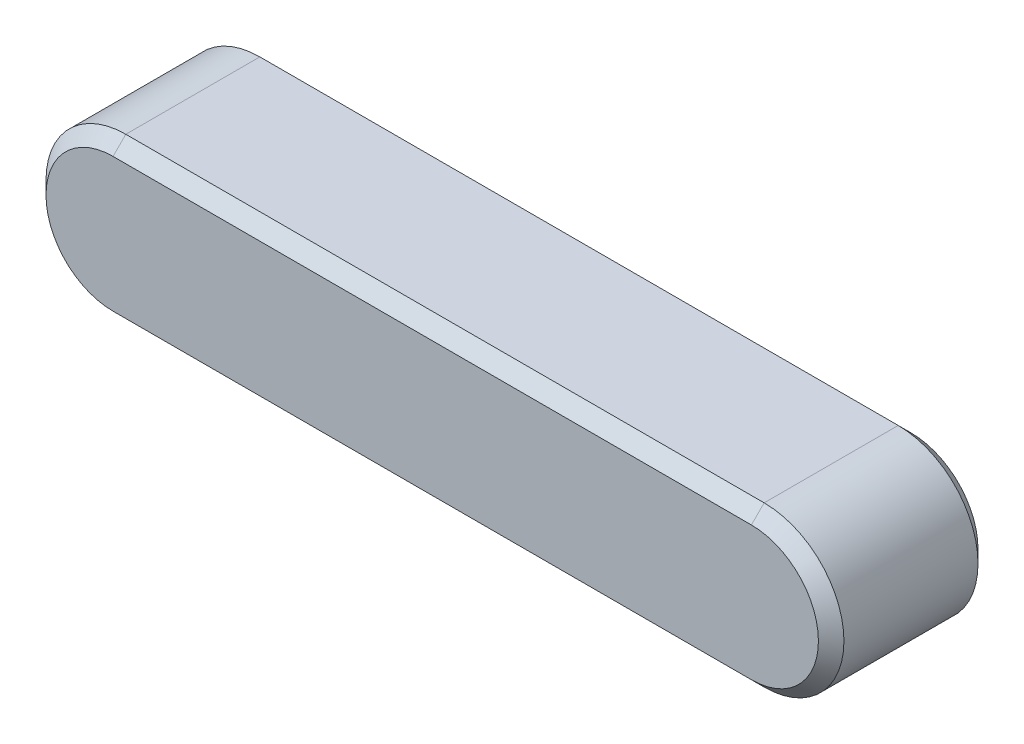
ISO-10303-21;
HEADER;
FILE_DESCRIPTION(('STEP AP214'),'2;1');
FILE_NAME('part.step','',(''),(''),'','','');
FILE_SCHEMA(('AUTOMOTIVE_DESIGN { 1 0 10303 214 1 1 1 1 }'));
ENDSEC;
DATA;
#1=APPLICATION_CONTEXT('core data for automotive mechanical design processes');
#2=APPLICATION_PROTOCOL_DEFINITION('international standard','automotive_design',2000,#1);
#3=PRODUCT_CONTEXT('',#1,'mechanical');
#4=PRODUCT('Part','Part','',(#3));
#5=PRODUCT_RELATED_PRODUCT_CATEGORY('part','',(#4));
#6=PRODUCT_DEFINITION_FORMATION('','',#4);
#7=PRODUCT_DEFINITION_CONTEXT('part definition',#1,'design');
#8=PRODUCT_DEFINITION('design','',#6,#7);
#9=PRODUCT_DEFINITION_SHAPE('','',#8);
#10=(LENGTH_UNIT() NAMED_UNIT(*) SI_UNIT(.MILLI.,.METRE.));
#11=(NAMED_UNIT(*) PLANE_ANGLE_UNIT() SI_UNIT($,.RADIAN.));
#12=(NAMED_UNIT(*) SI_UNIT($,.STERADIAN.) SOLID_ANGLE_UNIT());
#13=UNCERTAINTY_MEASURE_WITH_UNIT(LENGTH_MEASURE(1.E-05),#10,'distance_accuracy_value','');
#14=(GEOMETRIC_REPRESENTATION_CONTEXT(3) GLOBAL_UNCERTAINTY_ASSIGNED_CONTEXT((#13)) GLOBAL_UNIT_ASSIGNED_CONTEXT((#10,
#11,#12)) REPRESENTATION_CONTEXT('',''));
#15=CARTESIAN_POINT('',(0.,0.,0.));
#16=DIRECTION('',(0.,0.,1.));
#17=DIRECTION('',(1.,0.,0.));
#18=AXIS2_PLACEMENT_3D('',#15,#16,#17);
#19=CARTESIAN_POINT('',(-20.,0.,2.5));
#20=DIRECTION('',(0.,0.,-1.));
#21=DIRECTION('',(-1.,0.,0.));
#22=AXIS2_PLACEMENT_3D('',#19,#20,#21);
#23=CYLINDRICAL_SURFACE('',#22,2.5);
#24=DIRECTION('',(0.,0.,-1.));
#25=VECTOR('',#24,1.);
#26=CARTESIAN_POINT('',(-20.,-2.5,2.5));
#27=LINE('',#26,#25);
#28=CARTESIAN_POINT('',(-20.,-2.5,2.1));
#29=VERTEX_POINT('',#28);
#30=CARTESIAN_POINT('',(-20.,-2.5,-2.1));
#31=VERTEX_POINT('',#30);
#32=EDGE_CURVE('E122',#29,#31,#27,.T.);
#33=ORIENTED_EDGE('',*,*,#32,.F.);
#34=CARTESIAN_POINT('',(-20.,0.,2.1));
#35=DIRECTION('',(0.,0.,-1.));
#36=DIRECTION('',(-1.,0.,0.));
#37=AXIS2_PLACEMENT_3D('',#34,#35,#36);
#38=CIRCLE('',#37,2.5);
#39=CARTESIAN_POINT('',(-20.,2.5,2.1));
#40=VERTEX_POINT('',#39);
#41=EDGE_CURVE('E56',#29,#40,#38,.T.);
#42=ORIENTED_EDGE('',*,*,#41,.T.);
#43=DIRECTION('',(0.,0.,-1.));
#44=VECTOR('',#43,1.);
#45=CARTESIAN_POINT('',(-20.,2.5,2.5));
#46=LINE('',#45,#44);
#47=CARTESIAN_POINT('',(-20.,2.5,-2.1));
#48=VERTEX_POINT('',#47);
#49=EDGE_CURVE('E160',#40,#48,#46,.T.);
#50=ORIENTED_EDGE('',*,*,#49,.T.);
#51=CARTESIAN_POINT('',(-20.,0.,-2.1));
#52=DIRECTION('',(0.,0.,-1.));
#53=DIRECTION('',(-1.,0.,0.));
#54=AXIS2_PLACEMENT_3D('',#51,#52,#53);
#55=CIRCLE('',#54,2.5);
#56=EDGE_CURVE('E110',#48,#31,#55,.F.);
#57=ORIENTED_EDGE('',*,*,#56,.T.);
#58=EDGE_LOOP('',(#33,#42,#50,#57));
#59=FACE_BOUND('',#58,.T.);
#60=ADVANCED_FACE('F33',(#59),#23,.T.);
#61=CARTESIAN_POINT('',(0.,-2.5,2.5));
#62=DIRECTION('',(0.,1.,0.));
#63=DIRECTION('',(-1.,0.,0.));
#64=AXIS2_PLACEMENT_3D('',#61,#62,#63);
#65=PLANE('',#64);
#66=ORIENTED_EDGE('',*,*,#32,.T.);
#67=DIRECTION('',(1.,0.,0.));
#68=VECTOR('',#67,1.);
#69=CARTESIAN_POINT('',(0.,-2.5,-2.1));
#70=LINE('',#69,#68);
#71=CARTESIAN_POINT('',(0.,-2.5,-2.1));
#72=VERTEX_POINT('',#71);
#73=EDGE_CURVE('E121',#31,#72,#70,.T.);
#74=ORIENTED_EDGE('',*,*,#73,.T.);
#75=DIRECTION('',(0.,0.,-1.));
#76=VECTOR('',#75,1.);
#77=CARTESIAN_POINT('',(0.,-2.5,2.5));
#78=LINE('',#77,#76);
#79=CARTESIAN_POINT('',(0.,-2.5,2.1));
#80=VERTEX_POINT('',#79);
#81=EDGE_CURVE('E104',#80,#72,#78,.T.);
#82=ORIENTED_EDGE('',*,*,#81,.F.);
#83=DIRECTION('',(-1.,0.,0.));
#84=VECTOR('',#83,1.);
#85=CARTESIAN_POINT('',(0.,-2.5,2.1));
#86=LINE('',#85,#84);
#87=EDGE_CURVE('E119',#80,#29,#86,.T.);
#88=ORIENTED_EDGE('',*,*,#87,.T.);
#89=EDGE_LOOP('',(#66,#74,#82,#88));
#90=FACE_BOUND('',#89,.T.);
#91=ADVANCED_FACE('F118',(#90),#65,.F.);
#92=CARTESIAN_POINT('',(0.,0.,2.5));
#93=DIRECTION('',(0.,0.,-1.));
#94=DIRECTION('',(-1.,0.,0.));
#95=AXIS2_PLACEMENT_3D('',#92,#93,#94);
#96=CYLINDRICAL_SURFACE('',#95,2.5);
#97=DIRECTION('',(0.,0.,-1.));
#98=VECTOR('',#97,1.);
#99=CARTESIAN_POINT('',(0.,2.5,2.5));
#100=LINE('',#99,#98);
#101=CARTESIAN_POINT('',(0.,2.5,2.1));
#102=VERTEX_POINT('',#101);
#103=CARTESIAN_POINT('',(0.,2.5,-2.1));
#104=VERTEX_POINT('',#103);
#105=EDGE_CURVE('E105',#102,#104,#100,.T.);
#106=ORIENTED_EDGE('',*,*,#105,.F.);
#107=CARTESIAN_POINT('',(0.,0.,2.1));
#108=DIRECTION('',(0.,0.,-1.));
#109=DIRECTION('',(-1.,0.,0.));
#110=AXIS2_PLACEMENT_3D('',#107,#108,#109);
#111=CIRCLE('',#110,2.5);
#112=EDGE_CURVE('E101',#102,#80,#111,.T.);
#113=ORIENTED_EDGE('',*,*,#112,.T.);
#114=ORIENTED_EDGE('',*,*,#81,.T.);
#115=CARTESIAN_POINT('',(0.,0.,-2.1));
#116=DIRECTION('',(0.,0.,-1.));
#117=DIRECTION('',(-1.,0.,0.));
#118=AXIS2_PLACEMENT_3D('',#115,#116,#117);
#119=CIRCLE('',#118,2.5);
#120=EDGE_CURVE('E111',#72,#104,#119,.F.);
#121=ORIENTED_EDGE('',*,*,#120,.T.);
#122=EDGE_LOOP('',(#106,#113,#114,#121));
#123=FACE_BOUND('',#122,.T.);
#124=ADVANCED_FACE('F103',(#123),#96,.T.);
#125=CARTESIAN_POINT('',(-20.,2.5,2.5));
#126=DIRECTION('',(0.,-1.,0.));
#127=DIRECTION('',(1.,0.,0.));
#128=AXIS2_PLACEMENT_3D('',#125,#126,#127);
#129=PLANE('',#128);
#130=ORIENTED_EDGE('',*,*,#49,.F.);
#131=DIRECTION('',(1.,0.,0.));
#132=VECTOR('',#131,1.);
#133=CARTESIAN_POINT('',(-20.,2.5,2.1));
#134=LINE('',#133,#132);
#135=EDGE_CURVE('E11',#40,#102,#134,.T.);
#136=ORIENTED_EDGE('',*,*,#135,.T.);
#137=ORIENTED_EDGE('',*,*,#105,.T.);
#138=DIRECTION('',(-1.,0.,0.));
#139=VECTOR('',#138,1.);
#140=CARTESIAN_POINT('',(-20.,2.5,-2.1));
#141=LINE('',#140,#139);
#142=EDGE_CURVE('E42',#104,#48,#141,.T.);
#143=ORIENTED_EDGE('',*,*,#142,.T.);
#144=EDGE_LOOP('',(#130,#136,#137,#143));
#145=FACE_BOUND('',#144,.T.);
#146=ADVANCED_FACE('F210',(#145),#129,.F.);
#147=CARTESIAN_POINT('',(-20.,0.,2.5));
#148=DIRECTION('',(0.,0.,-1.));
#149=DIRECTION('',(-1.,0.,0.));
#150=AXIS2_PLACEMENT_3D('',#147,#148,#149);
#151=PLANE('',#150);
#152=CARTESIAN_POINT('',(-20.,0.,2.5));
#153=DIRECTION('',(0.,0.,-1.));
#154=DIRECTION('',(-1.,0.,0.));
#155=AXIS2_PLACEMENT_3D('',#152,#153,#154);
#156=CIRCLE('',#155,2.1);
#157=CARTESIAN_POINT('',(-20.,2.1,2.5));
#158=VERTEX_POINT('',#157);
#159=CARTESIAN_POINT('',(-20.,-2.1,2.5));
#160=VERTEX_POINT('',#159);
#161=EDGE_CURVE('E181',#158,#160,#156,.F.);
#162=ORIENTED_EDGE('',*,*,#161,.T.);
#163=DIRECTION('',(1.,0.,0.));
#164=VECTOR('',#163,1.);
#165=CARTESIAN_POINT('',(-20.,-2.10000000000001,2.5));
#166=LINE('',#165,#164);
#167=CARTESIAN_POINT('',(0.,-2.1,2.5));
#168=VERTEX_POINT('',#167);
#169=EDGE_CURVE('E184',#160,#168,#166,.T.);
#170=ORIENTED_EDGE('',*,*,#169,.T.);
#171=CARTESIAN_POINT('',(0.,0.,2.5));
#172=DIRECTION('',(0.,0.,-1.));
#173=DIRECTION('',(-1.,0.,0.));
#174=AXIS2_PLACEMENT_3D('',#171,#172,#173);
#175=CIRCLE('',#174,2.1);
#176=CARTESIAN_POINT('',(0.,2.1,2.5));
#177=VERTEX_POINT('',#176);
#178=EDGE_CURVE('E133',#168,#177,#175,.F.);
#179=ORIENTED_EDGE('',*,*,#178,.T.);
#180=DIRECTION('',(-1.,0.,0.));
#181=VECTOR('',#180,1.);
#182=CARTESIAN_POINT('',(-20.,2.1,2.5));
#183=LINE('',#182,#181);
#184=EDGE_CURVE('E179',#177,#158,#183,.T.);
#185=ORIENTED_EDGE('',*,*,#184,.T.);
#186=EDGE_LOOP('',(#162,#170,#179,#185));
#187=FACE_BOUND('',#186,.T.);
#188=ADVANCED_FACE('F213',(#187),#151,.F.);
#189=CARTESIAN_POINT('',(-20.,0.,-2.5));
#190=DIRECTION('',(0.,0.,-1.));
#191=DIRECTION('',(-1.,0.,0.));
#192=AXIS2_PLACEMENT_3D('',#189,#190,#191);
#193=PLANE('',#192);
#194=CARTESIAN_POINT('',(0.,0.,-2.5));
#195=DIRECTION('',(0.,0.,-1.));
#196=DIRECTION('',(-1.,0.,0.));
#197=AXIS2_PLACEMENT_3D('',#194,#195,#196);
#198=CIRCLE('',#197,2.1);
#199=CARTESIAN_POINT('',(0.,2.1,-2.5));
#200=VERTEX_POINT('',#199);
#201=CARTESIAN_POINT('',(0.,-2.1,-2.5));
#202=VERTEX_POINT('',#201);
#203=EDGE_CURVE('E174',#200,#202,#198,.T.);
#204=ORIENTED_EDGE('',*,*,#203,.T.);
#205=DIRECTION('',(-1.,0.,0.));
#206=VECTOR('',#205,1.);
#207=CARTESIAN_POINT('',(-20.,-2.10000000000001,-2.5));
#208=LINE('',#207,#206);
#209=CARTESIAN_POINT('',(-20.,-2.1,-2.5));
#210=VERTEX_POINT('',#209);
#211=EDGE_CURVE('E176',#202,#210,#208,.T.);
#212=ORIENTED_EDGE('',*,*,#211,.T.);
#213=CARTESIAN_POINT('',(-20.,0.,-2.5));
#214=DIRECTION('',(0.,0.,-1.));
#215=DIRECTION('',(-1.,0.,0.));
#216=AXIS2_PLACEMENT_3D('',#213,#214,#215);
#217=CIRCLE('',#216,2.1);
#218=CARTESIAN_POINT('',(-20.,2.1,-2.5));
#219=VERTEX_POINT('',#218);
#220=EDGE_CURVE('E172',#210,#219,#217,.T.);
#221=ORIENTED_EDGE('',*,*,#220,.T.);
#222=DIRECTION('',(1.,0.,0.));
#223=VECTOR('',#222,1.);
#224=CARTESIAN_POINT('',(0.,2.1,-2.5));
#225=LINE('',#224,#223);
#226=EDGE_CURVE('E170',#219,#200,#225,.T.);
#227=ORIENTED_EDGE('',*,*,#226,.T.);
#228=EDGE_LOOP('',(#204,#212,#221,#227));
#229=FACE_BOUND('',#228,.T.);
#230=ADVANCED_FACE('F214',(#229),#193,.T.);
#231=CARTESIAN_POINT('',(-20.,2.5,-2.1));
#232=DIRECTION('',(0.,0.707106781186548,-0.707106781186548));
#233=DIRECTION('',(0.,0.707106781186548,0.707106781186548));
#234=AXIS2_PLACEMENT_3D('',#231,#232,#233);
#235=PLANE('',#234);
#236=DIRECTION('',(0.,0.707106781186548,0.707106781186548));
#237=VECTOR('',#236,1.);
#238=CARTESIAN_POINT('',(0.,2.1,-2.5));
#239=LINE('',#238,#237);
#240=EDGE_CURVE('E152',#200,#104,#239,.T.);
#241=ORIENTED_EDGE('',*,*,#240,.F.);
#242=ORIENTED_EDGE('',*,*,#226,.F.);
#243=DIRECTION('',(0.,-0.707106781186548,-0.707106781186548));
#244=VECTOR('',#243,1.);
#245=CARTESIAN_POINT('',(-20.,2.5,-2.1));
#246=LINE('',#245,#244);
#247=EDGE_CURVE('E139',#48,#219,#246,.T.);
#248=ORIENTED_EDGE('',*,*,#247,.F.);
#249=ORIENTED_EDGE('',*,*,#142,.F.);
#250=EDGE_LOOP('',(#241,#242,#248,#249));
#251=FACE_BOUND('',#250,.T.);
#252=ADVANCED_FACE('F217',(#251),#235,.T.);
#253=CARTESIAN_POINT('',(-20.,0.,-2.1));
#254=DIRECTION('',(0.,0.,1.));
#255=DIRECTION('',(1.,0.,0.));
#256=AXIS2_PLACEMENT_3D('',#253,#254,#255);
#257=CONICAL_SURFACE('',#256,2.5,0.785398163397448);
#258=ORIENTED_EDGE('',*,*,#247,.T.);
#259=ORIENTED_EDGE('',*,*,#220,.F.);
#260=DIRECTION('',(0.,0.707106781186548,-0.707106781186548));
#261=VECTOR('',#260,1.);
#262=CARTESIAN_POINT('',(-20.,-2.5,-2.1));
#263=LINE('',#262,#261);
#264=EDGE_CURVE('E146',#31,#210,#263,.T.);
#265=ORIENTED_EDGE('',*,*,#264,.F.);
#266=ORIENTED_EDGE('',*,*,#56,.F.);
#267=EDGE_LOOP('',(#258,#259,#265,#266));
#268=FACE_BOUND('',#267,.T.);
#269=ADVANCED_FACE('F189',(#268),#257,.T.);
#270=CARTESIAN_POINT('',(0.,0.,-2.1));
#271=DIRECTION('',(0.,0.,1.));
#272=DIRECTION('',(1.,0.,0.));
#273=AXIS2_PLACEMENT_3D('',#270,#271,#272);
#274=CONICAL_SURFACE('',#273,2.5,0.785398163397448);
#275=ORIENTED_EDGE('',*,*,#240,.T.);
#276=ORIENTED_EDGE('',*,*,#120,.F.);
#277=DIRECTION('',(0.,-0.707106781186548,0.707106781186548));
#278=VECTOR('',#277,1.);
#279=CARTESIAN_POINT('',(0.,-2.1,-2.5));
#280=LINE('',#279,#278);
#281=EDGE_CURVE('E142',#202,#72,#280,.T.);
#282=ORIENTED_EDGE('',*,*,#281,.F.);
#283=ORIENTED_EDGE('',*,*,#203,.F.);
#284=EDGE_LOOP('',(#275,#276,#282,#283));
#285=FACE_BOUND('',#284,.T.);
#286=ADVANCED_FACE('F192',(#285),#274,.T.);
#287=CARTESIAN_POINT('',(0.,-2.5,-2.1));
#288=DIRECTION('',(0.,-0.707106781186548,-0.707106781186548));
#289=DIRECTION('',(0.,0.707106781186548,-0.707106781186548));
#290=AXIS2_PLACEMENT_3D('',#287,#288,#289);
#291=PLANE('',#290);
#292=ORIENTED_EDGE('',*,*,#264,.T.);
#293=ORIENTED_EDGE('',*,*,#211,.F.);
#294=ORIENTED_EDGE('',*,*,#281,.T.);
#295=ORIENTED_EDGE('',*,*,#73,.F.);
#296=EDGE_LOOP('',(#292,#293,#294,#295));
#297=FACE_BOUND('',#296,.T.);
#298=ADVANCED_FACE('F190',(#297),#291,.T.);
#299=CARTESIAN_POINT('',(-20.,2.1,2.5));
#300=DIRECTION('',(0.,-0.707106781186548,-0.707106781186548));
#301=DIRECTION('',(0.,0.707106781186548,-0.707106781186548));
#302=AXIS2_PLACEMENT_3D('',#299,#300,#301);
#303=PLANE('',#302);
#304=DIRECTION('',(0.,-0.707106781186548,0.707106781186548));
#305=VECTOR('',#304,1.);
#306=CARTESIAN_POINT('',(0.,2.5,2.1));
#307=LINE('',#306,#305);
#308=EDGE_CURVE('E136',#102,#177,#307,.T.);
#309=ORIENTED_EDGE('',*,*,#308,.F.);
#310=ORIENTED_EDGE('',*,*,#135,.F.);
#311=DIRECTION('',(0.,0.707106781186548,-0.707106781186548));
#312=VECTOR('',#311,1.);
#313=CARTESIAN_POINT('',(-20.,2.1,2.5));
#314=LINE('',#313,#312);
#315=EDGE_CURVE('E37',#158,#40,#314,.T.);
#316=ORIENTED_EDGE('',*,*,#315,.F.);
#317=ORIENTED_EDGE('',*,*,#184,.F.);
#318=EDGE_LOOP('',(#309,#310,#316,#317));
#319=FACE_BOUND('',#318,.T.);
#320=ADVANCED_FACE('F35',(#319),#303,.F.);
#321=CARTESIAN_POINT('',(-20.,0.,2.5));
#322=DIRECTION('',(0.,0.,-1.));
#323=DIRECTION('',(-1.,0.,0.));
#324=AXIS2_PLACEMENT_3D('',#321,#322,#323);
#325=CONICAL_SURFACE('',#324,2.1,0.785398163397448);
#326=ORIENTED_EDGE('',*,*,#315,.T.);
#327=ORIENTED_EDGE('',*,*,#41,.F.);
#328=DIRECTION('',(0.,-0.707106781186548,-0.707106781186548));
#329=VECTOR('',#328,1.);
#330=CARTESIAN_POINT('',(-20.,-2.1,2.5));
#331=LINE('',#330,#329);
#332=EDGE_CURVE('E130',#160,#29,#331,.T.);
#333=ORIENTED_EDGE('',*,*,#332,.F.);
#334=ORIENTED_EDGE('',*,*,#161,.F.);
#335=EDGE_LOOP('',(#326,#327,#333,#334));
#336=FACE_BOUND('',#335,.T.);
#337=ADVANCED_FACE('F198',(#336),#325,.T.);
#338=CARTESIAN_POINT('',(0.,0.,2.5));
#339=DIRECTION('',(0.,0.,-1.));
#340=DIRECTION('',(-1.,0.,0.));
#341=AXIS2_PLACEMENT_3D('',#338,#339,#340);
#342=CONICAL_SURFACE('',#341,2.1,0.785398163397448);
#343=ORIENTED_EDGE('',*,*,#308,.T.);
#344=ORIENTED_EDGE('',*,*,#178,.F.);
#345=DIRECTION('',(0.,0.707106781186548,0.707106781186548));
#346=VECTOR('',#345,1.);
#347=CARTESIAN_POINT('',(0.,-2.5,2.1));
#348=LINE('',#347,#346);
#349=EDGE_CURVE('E127',#80,#168,#348,.T.);
#350=ORIENTED_EDGE('',*,*,#349,.F.);
#351=ORIENTED_EDGE('',*,*,#112,.F.);
#352=EDGE_LOOP('',(#343,#344,#350,#351));
#353=FACE_BOUND('',#352,.T.);
#354=ADVANCED_FACE('F132',(#353),#342,.T.);
#355=CARTESIAN_POINT('',(-20.,-2.10000000000001,2.5));
#356=DIRECTION('',(0.,0.707106781186548,-0.707106781186548));
#357=DIRECTION('',(0.,0.707106781186548,0.707106781186548));
#358=AXIS2_PLACEMENT_3D('',#355,#356,#357);
#359=PLANE('',#358);
#360=ORIENTED_EDGE('',*,*,#332,.T.);
#361=ORIENTED_EDGE('',*,*,#87,.F.);
#362=ORIENTED_EDGE('',*,*,#349,.T.);
#363=ORIENTED_EDGE('',*,*,#169,.F.);
#364=EDGE_LOOP('',(#360,#361,#362,#363));
#365=FACE_BOUND('',#364,.T.);
#366=ADVANCED_FACE('F125',(#365),#359,.F.);
#367=CLOSED_SHELL('',(#60,#91,#124,#146,#188,#230,#252,#269,#286,#298,#320,#337,#354,#366));
#368=MANIFOLD_SOLID_BREP('B2',#367);
#369=ADVANCED_BREP_SHAPE_REPRESENTATION('',(#18,#368),#14);
#370=SHAPE_DEFINITION_REPRESENTATION(#9,#369);
ENDSEC;
END-ISO-10303-21;
